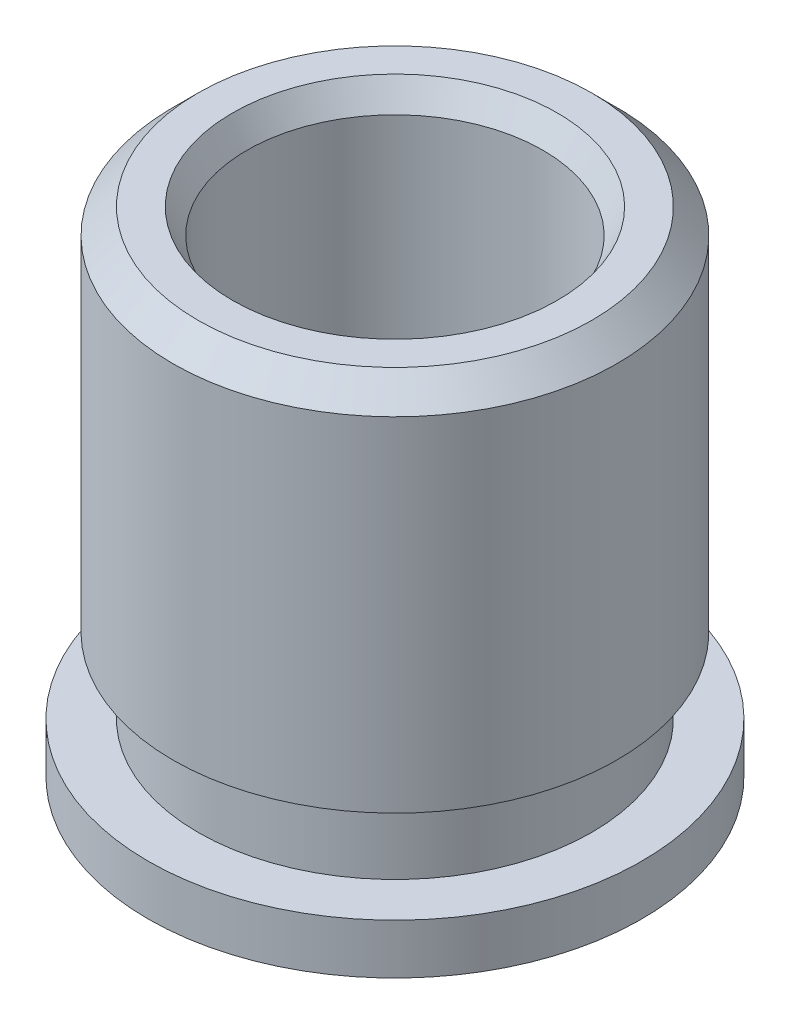
ISO-10303-21;
HEADER;
FILE_DESCRIPTION(('STEP AP214'),'2;1');
FILE_NAME('part.step','',(''),(''),'','','');
FILE_SCHEMA(('AUTOMOTIVE_DESIGN { 1 0 10303 214 1 1 1 1 }'));
ENDSEC;
DATA;
#1=APPLICATION_CONTEXT('core data for automotive mechanical design processes');
#2=APPLICATION_PROTOCOL_DEFINITION('international standard','automotive_design',2000,#1);
#3=PRODUCT_CONTEXT('',#1,'mechanical');
#4=PRODUCT('Part','Part','',(#3));
#5=PRODUCT_RELATED_PRODUCT_CATEGORY('part','',(#4));
#6=PRODUCT_DEFINITION_FORMATION('','',#4);
#7=PRODUCT_DEFINITION_CONTEXT('part definition',#1,'design');
#8=PRODUCT_DEFINITION('design','',#6,#7);
#9=PRODUCT_DEFINITION_SHAPE('','',#8);
#10=(LENGTH_UNIT() NAMED_UNIT(*) SI_UNIT(.MILLI.,.METRE.));
#11=(NAMED_UNIT(*) PLANE_ANGLE_UNIT() SI_UNIT($,.RADIAN.));
#12=(NAMED_UNIT(*) SI_UNIT($,.STERADIAN.) SOLID_ANGLE_UNIT());
#13=UNCERTAINTY_MEASURE_WITH_UNIT(LENGTH_MEASURE(1.E-05),#10,'distance_accuracy_value','');
#14=(GEOMETRIC_REPRESENTATION_CONTEXT(3) GLOBAL_UNCERTAINTY_ASSIGNED_CONTEXT((#13)) GLOBAL_UNIT_ASSIGNED_CONTEXT((#10,
#11,#12)) REPRESENTATION_CONTEXT('',''));
#15=CARTESIAN_POINT('',(0.,0.,0.));
#16=DIRECTION('',(0.,0.,1.));
#17=DIRECTION('',(1.,0.,0.));
#18=AXIS2_PLACEMENT_3D('',#15,#16,#17);
#19=CARTESIAN_POINT('',(0.,2.5019,0.));
#20=DIRECTION('',(0.,1.,0.));
#21=DIRECTION('',(0.,0.,1.));
#22=AXIS2_PLACEMENT_3D('',#19,#20,#21);
#23=CYLINDRICAL_SURFACE('',#22,2.5019);
#24=CARTESIAN_POINT('',(0.,-2.5019,0.));
#25=DIRECTION('',(0.,1.,0.));
#26=DIRECTION('',(0.,0.,1.));
#27=AXIS2_PLACEMENT_3D('',#24,#25,#26);
#28=CIRCLE('',#27,2.5019);
#29=CARTESIAN_POINT('',(0.,-2.5019,2.5019));
#30=VERTEX_POINT('',#29);
#31=EDGE_CURVE('E51',#30,#30,#28,.T.);
#32=ORIENTED_EDGE('',*,*,#31,.T.);
#33=EDGE_LOOP('',(#32));
#34=FACE_BOUND('',#33,.T.);
#35=CARTESIAN_POINT('',(0.,-1.9939,0.));
#36=DIRECTION('',(0.,1.,0.));
#37=DIRECTION('',(0.,0.,1.));
#38=AXIS2_PLACEMENT_3D('',#35,#36,#37);
#39=CIRCLE('',#38,2.5019);
#40=CARTESIAN_POINT('',(0.,-1.9939,2.5019));
#41=VERTEX_POINT('',#40);
#42=EDGE_CURVE('E9',#41,#41,#39,.T.);
#43=ORIENTED_EDGE('',*,*,#42,.F.);
#44=EDGE_LOOP('',(#43));
#45=FACE_BOUND('',#44,.T.);
#46=ADVANCED_FACE('F14',(#34,#45),#23,.T.);
#47=CARTESIAN_POINT('',(1.25095,-1.9939,0.));
#48=DIRECTION('',(0.,1.,0.));
#49=DIRECTION('',(0.,0.,1.));
#50=AXIS2_PLACEMENT_3D('',#47,#48,#49);
#51=PLANE('',#50);
#52=ORIENTED_EDGE('',*,*,#42,.T.);
#53=EDGE_LOOP('',(#52));
#54=FACE_BOUND('',#53,.T.);
#55=CARTESIAN_POINT('',(0.,-1.9939,0.));
#56=DIRECTION('',(0.,1.,0.));
#57=DIRECTION('',(0.,0.,1.));
#58=AXIS2_PLACEMENT_3D('',#55,#56,#57);
#59=CIRCLE('',#58,1.99644);
#60=CARTESIAN_POINT('',(0.,-1.9939,1.99644));
#61=VERTEX_POINT('',#60);
#62=EDGE_CURVE('E20',#61,#61,#59,.T.);
#63=ORIENTED_EDGE('',*,*,#62,.F.);
#64=EDGE_LOOP('',(#63));
#65=FACE_BOUND('',#64,.T.);
#66=ADVANCED_FACE('F77',(#54,#65),#51,.T.);
#67=CARTESIAN_POINT('',(0.,2.5019,0.));
#68=DIRECTION('',(0.,1.,0.));
#69=DIRECTION('',(0.,0.,1.));
#70=AXIS2_PLACEMENT_3D('',#67,#68,#69);
#71=CYLINDRICAL_SURFACE('',#70,1.99644);
#72=ORIENTED_EDGE('',*,*,#62,.T.);
#73=EDGE_LOOP('',(#72));
#74=FACE_BOUND('',#73,.T.);
#75=CARTESIAN_POINT('',(0.,-1.2319,0.));
#76=DIRECTION('',(0.,1.,0.));
#77=DIRECTION('',(0.,0.,1.));
#78=AXIS2_PLACEMENT_3D('',#75,#76,#77);
#79=CIRCLE('',#78,1.99644);
#80=CARTESIAN_POINT('',(0.,-1.2319,1.99644));
#81=VERTEX_POINT('',#80);
#82=EDGE_CURVE('E24',#81,#81,#79,.T.);
#83=ORIENTED_EDGE('',*,*,#82,.F.);
#84=EDGE_LOOP('',(#83));
#85=FACE_BOUND('',#84,.T.);
#86=ADVANCED_FACE('F82',(#74,#85),#71,.T.);
#87=CARTESIAN_POINT('',(1.25095,-1.2319,0.));
#88=DIRECTION('',(0.,-1.,0.));
#89=DIRECTION('',(0.,0.,-1.));
#90=AXIS2_PLACEMENT_3D('',#87,#88,#89);
#91=PLANE('',#90);
#92=ORIENTED_EDGE('',*,*,#82,.T.);
#93=EDGE_LOOP('',(#92));
#94=FACE_BOUND('',#93,.T.);
#95=CARTESIAN_POINT('',(0.,-1.2319,0.));
#96=DIRECTION('',(0.,1.,0.));
#97=DIRECTION('',(0.,0.,1.));
#98=AXIS2_PLACEMENT_3D('',#95,#96,#97);
#99=CIRCLE('',#98,2.25044);
#100=CARTESIAN_POINT('',(0.,-1.2319,2.25044));
#101=VERTEX_POINT('',#100);
#102=EDGE_CURVE('E28',#101,#101,#99,.T.);
#103=ORIENTED_EDGE('',*,*,#102,.F.);
#104=EDGE_LOOP('',(#103));
#105=FACE_BOUND('',#104,.T.);
#106=ADVANCED_FACE('F87',(#94,#105),#91,.T.);
#107=CARTESIAN_POINT('',(0.,2.5019,0.));
#108=DIRECTION('',(0.,1.,0.));
#109=DIRECTION('',(0.,0.,1.));
#110=AXIS2_PLACEMENT_3D('',#107,#108,#109);
#111=CYLINDRICAL_SURFACE('',#110,2.25044);
#112=ORIENTED_EDGE('',*,*,#102,.T.);
#113=EDGE_LOOP('',(#112));
#114=FACE_BOUND('',#113,.T.);
#115=CARTESIAN_POINT('',(0.,2.2479,0.));
#116=DIRECTION('',(0.,1.,0.));
#117=DIRECTION('',(0.,0.,1.));
#118=AXIS2_PLACEMENT_3D('',#115,#116,#117);
#119=CIRCLE('',#118,2.25044);
#120=CARTESIAN_POINT('',(0.,2.2479,2.25044));
#121=VERTEX_POINT('',#120);
#122=EDGE_CURVE('E33',#121,#121,#119,.T.);
#123=ORIENTED_EDGE('',*,*,#122,.F.);
#124=EDGE_LOOP('',(#123));
#125=FACE_BOUND('',#124,.T.);
#126=ADVANCED_FACE('F93',(#114,#125),#111,.T.);
#127=CARTESIAN_POINT('',(0.,2.5019,0.));
#128=DIRECTION('',(0.,-1.,0.));
#129=DIRECTION('',(0.,0.,-1.));
#130=AXIS2_PLACEMENT_3D('',#127,#128,#129);
#131=CONICAL_SURFACE('',#130,1.99644,0.785398163397448);
#132=ORIENTED_EDGE('',*,*,#122,.T.);
#133=EDGE_LOOP('',(#132));
#134=FACE_BOUND('',#133,.T.);
#135=CARTESIAN_POINT('',(0.,2.5019,0.));
#136=DIRECTION('',(0.,1.,0.));
#137=DIRECTION('',(0.,0.,1.));
#138=AXIS2_PLACEMENT_3D('',#135,#136,#137);
#139=CIRCLE('',#138,1.99644);
#140=CARTESIAN_POINT('',(0.,2.5019,1.99644));
#141=VERTEX_POINT('',#140);
#142=EDGE_CURVE('E36',#141,#141,#139,.T.);
#143=ORIENTED_EDGE('',*,*,#142,.F.);
#144=EDGE_LOOP('',(#143));
#145=FACE_BOUND('',#144,.T.);
#146=ADVANCED_FACE('F97',(#134,#145),#131,.T.);
#147=CARTESIAN_POINT('',(1.25095,2.5019,0.));
#148=DIRECTION('',(0.,1.,0.));
#149=DIRECTION('',(0.,0.,1.));
#150=AXIS2_PLACEMENT_3D('',#147,#148,#149);
#151=PLANE('',#150);
#152=ORIENTED_EDGE('',*,*,#142,.T.);
#153=EDGE_LOOP('',(#152));
#154=FACE_BOUND('',#153,.T.);
#155=CARTESIAN_POINT('',(0.,2.5019,0.));
#156=DIRECTION('',(0.,1.,0.));
#157=DIRECTION('',(0.,0.,1.));
#158=AXIS2_PLACEMENT_3D('',#155,#156,#157);
#159=CIRCLE('',#158,1.64664696837417);
#160=CARTESIAN_POINT('',(0.,2.5019,1.64664696837417));
#161=VERTEX_POINT('',#160);
#162=EDGE_CURVE('E39',#161,#161,#159,.T.);
#163=ORIENTED_EDGE('',*,*,#162,.F.);
#164=EDGE_LOOP('',(#163));
#165=FACE_BOUND('',#164,.T.);
#166=ADVANCED_FACE('F101',(#154,#165),#151,.T.);
#167=CARTESIAN_POINT('',(0.,2.2479,0.));
#168=DIRECTION('',(0.,1.,0.));
#169=DIRECTION('',(0.,0.,1.));
#170=AXIS2_PLACEMENT_3D('',#167,#168,#169);
#171=CONICAL_SURFACE('',#170,1.5,0.523598775598301);
#172=ORIENTED_EDGE('',*,*,#162,.T.);
#173=EDGE_LOOP('',(#172));
#174=FACE_BOUND('',#173,.T.);
#175=CARTESIAN_POINT('',(0.,2.2479,0.));
#176=DIRECTION('',(0.,1.,0.));
#177=DIRECTION('',(0.,0.,1.));
#178=AXIS2_PLACEMENT_3D('',#175,#176,#177);
#179=CIRCLE('',#178,1.5);
#180=CARTESIAN_POINT('',(0.,2.2479,1.5));
#181=VERTEX_POINT('',#180);
#182=EDGE_CURVE('E42',#181,#181,#179,.T.);
#183=ORIENTED_EDGE('',*,*,#182,.F.);
#184=EDGE_LOOP('',(#183));
#185=FACE_BOUND('',#184,.T.);
#186=ADVANCED_FACE('F73',(#174,#185),#171,.F.);
#187=CARTESIAN_POINT('',(0.,2.5019,0.));
#188=DIRECTION('',(0.,1.,0.));
#189=DIRECTION('',(0.,0.,1.));
#190=AXIS2_PLACEMENT_3D('',#187,#188,#189);
#191=CYLINDRICAL_SURFACE('',#190,1.5);
#192=ORIENTED_EDGE('',*,*,#182,.T.);
#193=EDGE_LOOP('',(#192));
#194=FACE_BOUND('',#193,.T.);
#195=CARTESIAN_POINT('',(0.,-2.2479,0.));
#196=DIRECTION('',(0.,1.,0.));
#197=DIRECTION('',(0.,0.,1.));
#198=AXIS2_PLACEMENT_3D('',#195,#196,#197);
#199=CIRCLE('',#198,1.5);
#200=CARTESIAN_POINT('',(0.,-2.2479,1.5));
#201=VERTEX_POINT('',#200);
#202=EDGE_CURVE('E45',#201,#201,#199,.T.);
#203=ORIENTED_EDGE('',*,*,#202,.F.);
#204=EDGE_LOOP('',(#203));
#205=FACE_BOUND('',#204,.T.);
#206=ADVANCED_FACE('F65',(#194,#205),#191,.F.);
#207=CARTESIAN_POINT('',(0.,-2.5019,0.));
#208=DIRECTION('',(0.,-1.,0.));
#209=DIRECTION('',(0.,0.,-1.));
#210=AXIS2_PLACEMENT_3D('',#207,#208,#209);
#211=CONICAL_SURFACE('',#210,1.64664696837417,0.523598775598299);
#212=ORIENTED_EDGE('',*,*,#202,.T.);
#213=EDGE_LOOP('',(#212));
#214=FACE_BOUND('',#213,.T.);
#215=CARTESIAN_POINT('',(0.,-2.5019,0.));
#216=DIRECTION('',(0.,1.,0.));
#217=DIRECTION('',(0.,0.,1.));
#218=AXIS2_PLACEMENT_3D('',#215,#216,#217);
#219=CIRCLE('',#218,1.64664696837417);
#220=CARTESIAN_POINT('',(0.,-2.5019,1.64664696837417));
#221=VERTEX_POINT('',#220);
#222=EDGE_CURVE('E48',#221,#221,#219,.T.);
#223=ORIENTED_EDGE('',*,*,#222,.F.);
#224=EDGE_LOOP('',(#223));
#225=FACE_BOUND('',#224,.T.);
#226=ADVANCED_FACE('F60',(#214,#225),#211,.F.);
#227=CARTESIAN_POINT('',(1.25095,-2.5019,0.));
#228=DIRECTION('',(0.,1.,0.));
#229=DIRECTION('',(0.,0.,1.));
#230=AXIS2_PLACEMENT_3D('',#227,#228,#229);
#231=PLANE('',#230);
#232=ORIENTED_EDGE('',*,*,#31,.F.);
#233=EDGE_LOOP('',(#232));
#234=FACE_BOUND('',#233,.T.);
#235=ORIENTED_EDGE('',*,*,#222,.T.);
#236=EDGE_LOOP('',(#235));
#237=FACE_BOUND('',#236,.T.);
#238=ADVANCED_FACE('F57',(#234,#237),#231,.F.);
#239=CLOSED_SHELL('',(#46,#66,#86,#106,#126,#146,#166,#186,#206,#226,#238));
#240=MANIFOLD_SOLID_BREP('B1',#239);
#241=ADVANCED_BREP_SHAPE_REPRESENTATION('',(#18,#240),#14);
#242=SHAPE_DEFINITION_REPRESENTATION(#9,#241);
ENDSEC;
END-ISO-10303-21;
